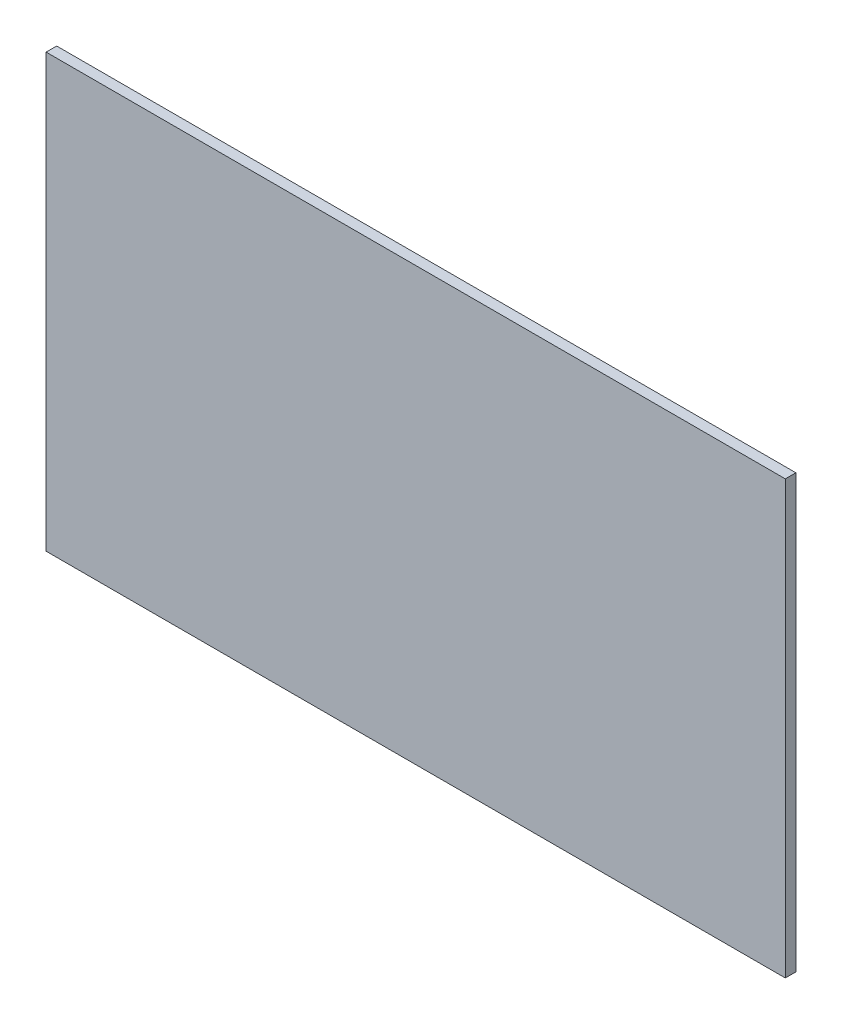
ISO-10303-21;
HEADER;
FILE_DESCRIPTION(('STEP AP214'),'2;1');
FILE_NAME('part.step','',(''),(''),'','','');
FILE_SCHEMA(('AUTOMOTIVE_DESIGN { 1 0 10303 214 1 1 1 1 }'));
ENDSEC;
DATA;
#1=APPLICATION_CONTEXT('core data for automotive mechanical design processes');
#2=APPLICATION_PROTOCOL_DEFINITION('international standard','automotive_design',2000,#1);
#3=PRODUCT_CONTEXT('',#1,'mechanical');
#4=PRODUCT('Part','Part','',(#3));
#5=PRODUCT_RELATED_PRODUCT_CATEGORY('part','',(#4));
#6=PRODUCT_DEFINITION_FORMATION('','',#4);
#7=PRODUCT_DEFINITION_CONTEXT('part definition',#1,'design');
#8=PRODUCT_DEFINITION('design','',#6,#7);
#9=PRODUCT_DEFINITION_SHAPE('','',#8);
#10=(LENGTH_UNIT() NAMED_UNIT(*) SI_UNIT(.MILLI.,.METRE.));
#11=(NAMED_UNIT(*) PLANE_ANGLE_UNIT() SI_UNIT($,.RADIAN.));
#12=(NAMED_UNIT(*) SI_UNIT($,.STERADIAN.) SOLID_ANGLE_UNIT());
#13=UNCERTAINTY_MEASURE_WITH_UNIT(LENGTH_MEASURE(1.E-05),#10,'distance_accuracy_value','');
#14=(GEOMETRIC_REPRESENTATION_CONTEXT(3) GLOBAL_UNCERTAINTY_ASSIGNED_CONTEXT((#13)) GLOBAL_UNIT_ASSIGNED_CONTEXT((#10,
#11,#12)) REPRESENTATION_CONTEXT('',''));
#15=CARTESIAN_POINT('',(0.,0.,0.));
#16=DIRECTION('',(0.,0.,1.));
#17=DIRECTION('',(1.,0.,0.));
#18=AXIS2_PLACEMENT_3D('',#15,#16,#17);
#19=CARTESIAN_POINT('',(-136.298076923077,-74.7596153846154,20.));
#20=DIRECTION('',(1.,0.,0.));
#21=DIRECTION('',(0.,0.,-1.));
#22=AXIS2_PLACEMENT_3D('',#19,#20,#21);
#23=PLANE('',#22);
#24=DIRECTION('',(0.,-1.,0.));
#25=VECTOR('',#24,1.);
#26=CARTESIAN_POINT('',(-136.298076923077,-74.7596153846154,0.));
#27=LINE('',#26,#25);
#28=CARTESIAN_POINT('',(-136.298076923077,1325.24038461538,0.));
#29=VERTEX_POINT('',#28);
#30=CARTESIAN_POINT('',(-136.298076923077,506.547287870607,0.));
#31=VERTEX_POINT('',#30);
#32=EDGE_CURVE('E81',#29,#31,#27,.T.);
#33=ORIENTED_EDGE('',*,*,#32,.T.);
#34=DIRECTION('',(0.,0.,-1.));
#35=VECTOR('',#34,1.);
#36=CARTESIAN_POINT('',(-136.298076923077,506.547287870607,20.));
#37=LINE('',#36,#35);
#38=CARTESIAN_POINT('',(-136.298076923077,506.547287870607,20.));
#39=VERTEX_POINT('',#38);
#40=EDGE_CURVE('E47',#39,#31,#37,.T.);
#41=ORIENTED_EDGE('',*,*,#40,.F.);
#42=DIRECTION('',(0.,-1.,0.));
#43=VECTOR('',#42,1.);
#44=CARTESIAN_POINT('',(-136.298076923077,-74.7596153846154,20.));
#45=LINE('',#44,#43);
#46=CARTESIAN_POINT('',(-136.298076923077,1325.24038461538,20.));
#47=VERTEX_POINT('',#46);
#48=EDGE_CURVE('E76',#47,#39,#45,.T.);
#49=ORIENTED_EDGE('',*,*,#48,.F.);
#50=DIRECTION('',(0.,0.,-1.));
#51=VECTOR('',#50,1.);
#52=CARTESIAN_POINT('',(-136.298076923077,1325.24038461538,20.));
#53=LINE('',#52,#51);
#54=EDGE_CURVE('E40',#47,#29,#53,.T.);
#55=ORIENTED_EDGE('',*,*,#54,.T.);
#56=EDGE_LOOP('',(#33,#41,#49,#55));
#57=FACE_BOUND('',#56,.T.);
#58=ADVANCED_FACE('F33',(#57),#23,.F.);
#59=CARTESIAN_POINT('',(1263.70192307692,-74.7596153846154,20.));
#60=DIRECTION('',(-1.,0.,0.));
#61=DIRECTION('',(0.,0.,1.));
#62=AXIS2_PLACEMENT_3D('',#59,#60,#61);
#63=PLANE('',#62);
#64=DIRECTION('',(0.,1.,0.));
#65=VECTOR('',#64,1.);
#66=CARTESIAN_POINT('',(1263.70192307692,-74.7596153846154,20.));
#67=LINE('',#66,#65);
#68=CARTESIAN_POINT('',(1263.70192307692,506.547287870607,20.));
#69=VERTEX_POINT('',#68);
#70=CARTESIAN_POINT('',(1263.70192307692,1325.24038461538,20.));
#71=VERTEX_POINT('',#70);
#72=EDGE_CURVE('E91',#69,#71,#67,.T.);
#73=ORIENTED_EDGE('',*,*,#72,.F.);
#74=DIRECTION('',(0.,0.,-1.));
#75=VECTOR('',#74,1.);
#76=CARTESIAN_POINT('',(1263.70192307692,506.547287870607,20.));
#77=LINE('',#76,#75);
#78=CARTESIAN_POINT('',(1263.70192307692,506.547287870607,0.));
#79=VERTEX_POINT('',#78);
#80=EDGE_CURVE('E84',#69,#79,#77,.T.);
#81=ORIENTED_EDGE('',*,*,#80,.T.);
#82=DIRECTION('',(0.,1.,0.));
#83=VECTOR('',#82,1.);
#84=CARTESIAN_POINT('',(1263.70192307692,-74.7596153846154,0.));
#85=LINE('',#84,#83);
#86=CARTESIAN_POINT('',(1263.70192307692,1325.24038461538,0.));
#87=VERTEX_POINT('',#86);
#88=EDGE_CURVE('E77',#79,#87,#85,.T.);
#89=ORIENTED_EDGE('',*,*,#88,.T.);
#90=DIRECTION('',(0.,0.,-1.));
#91=VECTOR('',#90,1.);
#92=CARTESIAN_POINT('',(1263.70192307692,1325.24038461538,20.));
#93=LINE('',#92,#91);
#94=EDGE_CURVE('E11',#71,#87,#93,.T.);
#95=ORIENTED_EDGE('',*,*,#94,.F.);
#96=EDGE_LOOP('',(#73,#81,#89,#95));
#97=FACE_BOUND('',#96,.T.);
#98=ADVANCED_FACE('F104',(#97),#63,.F.);
#99=CARTESIAN_POINT('',(-136.298076923077,1325.24038461538,20.));
#100=DIRECTION('',(0.,-1.,0.));
#101=DIRECTION('',(0.,0.,-1.));
#102=AXIS2_PLACEMENT_3D('',#99,#100,#101);
#103=PLANE('',#102);
#104=DIRECTION('',(-1.,0.,0.));
#105=VECTOR('',#104,1.);
#106=CARTESIAN_POINT('',(-136.298076923077,1325.24038461538,0.));
#107=LINE('',#106,#105);
#108=EDGE_CURVE('E68',#87,#29,#107,.T.);
#109=ORIENTED_EDGE('',*,*,#108,.T.);
#110=ORIENTED_EDGE('',*,*,#54,.F.);
#111=DIRECTION('',(-1.,0.,0.));
#112=VECTOR('',#111,1.);
#113=CARTESIAN_POINT('',(-136.298076923077,1325.24038461538,20.));
#114=LINE('',#113,#112);
#115=EDGE_CURVE('E56',#71,#47,#114,.T.);
#116=ORIENTED_EDGE('',*,*,#115,.F.);
#117=ORIENTED_EDGE('',*,*,#94,.T.);
#118=EDGE_LOOP('',(#109,#110,#116,#117));
#119=FACE_BOUND('',#118,.T.);
#120=ADVANCED_FACE('F70',(#119),#103,.F.);
#121=CARTESIAN_POINT('',(0.,0.,20.));
#122=DIRECTION('',(0.,0.,-1.));
#123=DIRECTION('',(-1.,0.,0.));
#124=AXIS2_PLACEMENT_3D('',#121,#122,#123);
#125=PLANE('',#124);
#126=ORIENTED_EDGE('',*,*,#48,.T.);
#127=DIRECTION('',(1.,0.,0.));
#128=VECTOR('',#127,1.);
#129=CARTESIAN_POINT('',(1263.70192307692,506.547287870607,20.));
#130=LINE('',#129,#128);
#131=EDGE_CURVE('E94',#39,#69,#130,.T.);
#132=ORIENTED_EDGE('',*,*,#131,.T.);
#133=ORIENTED_EDGE('',*,*,#72,.T.);
#134=ORIENTED_EDGE('',*,*,#115,.T.);
#135=EDGE_LOOP('',(#126,#132,#133,#134));
#136=FACE_BOUND('',#135,.T.);
#137=ADVANCED_FACE('F99',(#136),#125,.F.);
#138=CARTESIAN_POINT('',(0.,0.,0.));
#139=DIRECTION('',(0.,0.,-1.));
#140=DIRECTION('',(-1.,0.,0.));
#141=AXIS2_PLACEMENT_3D('',#138,#139,#140);
#142=PLANE('',#141);
#143=DIRECTION('',(1.,0.,0.));
#144=VECTOR('',#143,1.);
#145=CARTESIAN_POINT('',(1263.70192307692,506.547287870607,0.));
#146=LINE('',#145,#144);
#147=EDGE_CURVE('E83',#31,#79,#146,.T.);
#148=ORIENTED_EDGE('',*,*,#147,.F.);
#149=ORIENTED_EDGE('',*,*,#32,.F.);
#150=ORIENTED_EDGE('',*,*,#108,.F.);
#151=ORIENTED_EDGE('',*,*,#88,.F.);
#152=EDGE_LOOP('',(#148,#149,#150,#151));
#153=FACE_BOUND('',#152,.T.);
#154=ADVANCED_FACE('F82',(#153),#142,.T.);
#155=CARTESIAN_POINT('',(1263.70192307692,506.547287870607,20.));
#156=DIRECTION('',(0.,1.,0.));
#157=DIRECTION('',(0.,0.,1.));
#158=AXIS2_PLACEMENT_3D('',#155,#156,#157);
#159=PLANE('',#158);
#160=ORIENTED_EDGE('',*,*,#147,.T.);
#161=ORIENTED_EDGE('',*,*,#80,.F.);
#162=ORIENTED_EDGE('',*,*,#131,.F.);
#163=ORIENTED_EDGE('',*,*,#40,.T.);
#164=EDGE_LOOP('',(#160,#161,#162,#163));
#165=FACE_BOUND('',#164,.T.);
#166=ADVANCED_FACE('F107',(#165),#159,.F.);
#167=CLOSED_SHELL('',(#58,#98,#120,#137,#154,#166));
#168=MANIFOLD_SOLID_BREP('B2',#167);
#169=ADVANCED_BREP_SHAPE_REPRESENTATION('',(#18,#168),#14);
#170=SHAPE_DEFINITION_REPRESENTATION(#9,#169);
ENDSEC;
END-ISO-10303-21;
